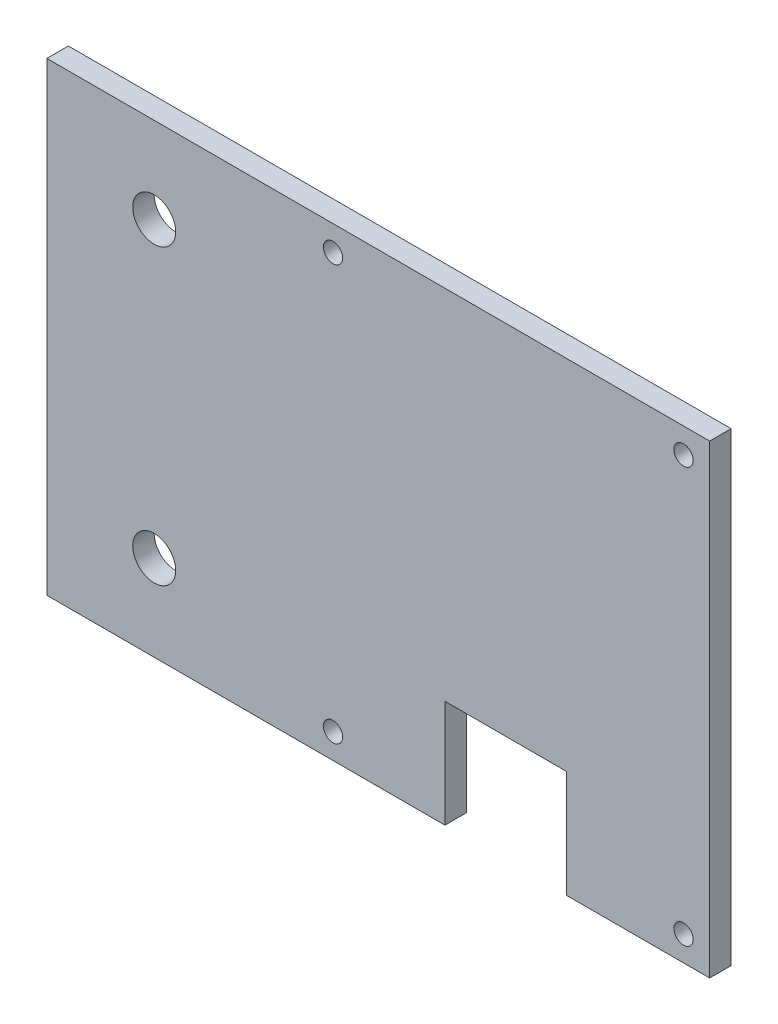
ISO-10303-21;
HEADER;
FILE_DESCRIPTION(('STEP AP214'),'2;1');
FILE_NAME('part.step','',(''),(''),'','','');
FILE_SCHEMA(('AUTOMOTIVE_DESIGN { 1 0 10303 214 1 1 1 1 }'));
ENDSEC;
DATA;
#1=APPLICATION_CONTEXT('core data for automotive mechanical design processes');
#2=APPLICATION_PROTOCOL_DEFINITION('international standard','automotive_design',2000,#1);
#3=PRODUCT_CONTEXT('',#1,'mechanical');
#4=PRODUCT('Part','Part','',(#3));
#5=PRODUCT_RELATED_PRODUCT_CATEGORY('part','',(#4));
#6=PRODUCT_DEFINITION_FORMATION('','',#4);
#7=PRODUCT_DEFINITION_CONTEXT('part definition',#1,'design');
#8=PRODUCT_DEFINITION('design','',#6,#7);
#9=PRODUCT_DEFINITION_SHAPE('','',#8);
#10=(LENGTH_UNIT() NAMED_UNIT(*) SI_UNIT(.MILLI.,.METRE.));
#11=(NAMED_UNIT(*) PLANE_ANGLE_UNIT() SI_UNIT($,.RADIAN.));
#12=(NAMED_UNIT(*) SI_UNIT($,.STERADIAN.) SOLID_ANGLE_UNIT());
#13=UNCERTAINTY_MEASURE_WITH_UNIT(LENGTH_MEASURE(1.E-05),#10,'distance_accuracy_value','');
#14=(GEOMETRIC_REPRESENTATION_CONTEXT(3) GLOBAL_UNCERTAINTY_ASSIGNED_CONTEXT((#13)) GLOBAL_UNIT_ASSIGNED_CONTEXT((#10,
#11,#12)) REPRESENTATION_CONTEXT('',''));
#15=CARTESIAN_POINT('',(0.,0.,0.));
#16=DIRECTION('',(0.,0.,1.));
#17=DIRECTION('',(1.,0.,0.));
#18=AXIS2_PLACEMENT_3D('',#15,#16,#17);
#19=CARTESIAN_POINT('',(0.,0.,3.));
#20=DIRECTION('',(0.,1.,0.));
#21=DIRECTION('',(0.,0.,1.));
#22=AXIS2_PLACEMENT_3D('',#19,#20,#21);
#23=PLANE('',#22);
#24=DIRECTION('',(1.,0.,0.));
#25=VECTOR('',#24,1.);
#26=CARTESIAN_POINT('',(0.,0.,0.));
#27=LINE('',#26,#25);
#28=CARTESIAN_POINT('',(0.,0.,0.));
#29=VERTEX_POINT('',#28);
#30=CARTESIAN_POINT('',(55.65,0.,0.));
#31=VERTEX_POINT('',#30);
#32=EDGE_CURVE('E134',#29,#31,#27,.T.);
#33=ORIENTED_EDGE('',*,*,#32,.T.);
#34=DIRECTION('',(0.,0.,1.));
#35=VECTOR('',#34,1.);
#36=CARTESIAN_POINT('',(55.65,0.,0.));
#37=LINE('',#36,#35);
#38=CARTESIAN_POINT('',(55.65,0.,3.));
#39=VERTEX_POINT('',#38);
#40=EDGE_CURVE('E118',#31,#39,#37,.T.);
#41=ORIENTED_EDGE('',*,*,#40,.T.);
#42=DIRECTION('',(1.,0.,0.));
#43=VECTOR('',#42,1.);
#44=CARTESIAN_POINT('',(0.,0.,3.));
#45=LINE('',#44,#43);
#46=CARTESIAN_POINT('',(0.,0.,3.));
#47=VERTEX_POINT('',#46);
#48=EDGE_CURVE('E96',#47,#39,#45,.T.);
#49=ORIENTED_EDGE('',*,*,#48,.F.);
#50=DIRECTION('',(0.,0.,-1.));
#51=VECTOR('',#50,1.);
#52=CARTESIAN_POINT('',(0.,0.,3.));
#53=LINE('',#52,#51);
#54=EDGE_CURVE('E11',#47,#29,#53,.T.);
#55=ORIENTED_EDGE('',*,*,#54,.T.);
#56=EDGE_LOOP('',(#33,#41,#49,#55));
#57=FACE_BOUND('',#56,.T.);
#58=ADVANCED_FACE('F43',(#57),#23,.F.);
#59=CARTESIAN_POINT('',(0.,0.,3.));
#60=DIRECTION('',(0.,0.,-1.));
#61=DIRECTION('',(-1.,0.,0.));
#62=AXIS2_PLACEMENT_3D('',#59,#60,#61);
#63=PLANE('',#62);
#64=CARTESIAN_POINT('',(15.,12.,3.));
#65=DIRECTION('',(0.,0.,-1.));
#66=DIRECTION('',(-1.,0.,0.));
#67=AXIS2_PLACEMENT_3D('',#64,#65,#66);
#68=CIRCLE('',#67,3.);
#69=CARTESIAN_POINT('',(12.,12.,3.));
#70=VERTEX_POINT('',#69);
#71=EDGE_CURVE('E215',#70,#70,#68,.T.);
#72=ORIENTED_EDGE('',*,*,#71,.T.);
#73=EDGE_LOOP('',(#72));
#74=FACE_BOUND('',#73,.T.);
#75=CARTESIAN_POINT('',(89.,61.5,3.));
#76=DIRECTION('',(0.,0.,1.));
#77=DIRECTION('',(1.,0.,0.));
#78=AXIS2_PLACEMENT_3D('',#75,#76,#77);
#79=CIRCLE('',#78,1.35000000000001);
#80=CARTESIAN_POINT('',(90.35,61.5,3.));
#81=VERTEX_POINT('',#80);
#82=EDGE_CURVE('E245',#81,#81,#79,.T.);
#83=ORIENTED_EDGE('',*,*,#82,.F.);
#84=EDGE_LOOP('',(#83));
#85=FACE_BOUND('',#84,.T.);
#86=CARTESIAN_POINT('',(89.,3.5,3.));
#87=DIRECTION('',(0.,0.,1.));
#88=DIRECTION('',(1.,0.,0.));
#89=AXIS2_PLACEMENT_3D('',#86,#87,#88);
#90=CIRCLE('',#89,1.35000000000001);
#91=CARTESIAN_POINT('',(90.35,3.5,3.));
#92=VERTEX_POINT('',#91);
#93=EDGE_CURVE('E249',#92,#92,#90,.T.);
#94=ORIENTED_EDGE('',*,*,#93,.F.);
#95=EDGE_LOOP('',(#94));
#96=FACE_BOUND('',#95,.T.);
#97=ORIENTED_EDGE('',*,*,#48,.T.);
#98=DIRECTION('',(0.,-1.,0.));
#99=VECTOR('',#98,1.);
#100=CARTESIAN_POINT('',(55.65,0.,3.));
#101=LINE('',#100,#99);
#102=CARTESIAN_POINT('',(55.65,15.,3.));
#103=VERTEX_POINT('',#102);
#104=EDGE_CURVE('E124',#103,#39,#101,.T.);
#105=ORIENTED_EDGE('',*,*,#104,.F.);
#106=DIRECTION('',(-1.,0.,0.));
#107=VECTOR('',#106,1.);
#108=CARTESIAN_POINT('',(55.65,15.,3.));
#109=LINE('',#108,#107);
#110=CARTESIAN_POINT('',(72.65,15.,3.));
#111=VERTEX_POINT('',#110);
#112=EDGE_CURVE('E137',#111,#103,#109,.T.);
#113=ORIENTED_EDGE('',*,*,#112,.F.);
#114=DIRECTION('',(0.,1.,0.));
#115=VECTOR('',#114,1.);
#116=CARTESIAN_POINT('',(72.65,0.,3.));
#117=LINE('',#116,#115);
#118=CARTESIAN_POINT('',(72.65,0.,3.));
#119=VERTEX_POINT('',#118);
#120=EDGE_CURVE('E214',#119,#111,#117,.T.);
#121=ORIENTED_EDGE('',*,*,#120,.F.);
#122=CARTESIAN_POINT('',(92.65,0.,3.));
#123=VERTEX_POINT('',#122);
#124=EDGE_CURVE('E198',#119,#123,#45,.T.);
#125=ORIENTED_EDGE('',*,*,#124,.T.);
#126=DIRECTION('',(0.,1.,0.));
#127=VECTOR('',#126,1.);
#128=CARTESIAN_POINT('',(92.65,0.,3.));
#129=LINE('',#128,#127);
#130=CARTESIAN_POINT('',(92.65,65.,3.));
#131=VERTEX_POINT('',#130);
#132=EDGE_CURVE('E171',#123,#131,#129,.T.);
#133=ORIENTED_EDGE('',*,*,#132,.T.);
#134=DIRECTION('',(-1.,0.,0.));
#135=VECTOR('',#134,1.);
#136=CARTESIAN_POINT('',(0.,65.,3.));
#137=LINE('',#136,#135);
#138=CARTESIAN_POINT('',(0.,65.,3.));
#139=VERTEX_POINT('',#138);
#140=EDGE_CURVE('E68',#131,#139,#137,.T.);
#141=ORIENTED_EDGE('',*,*,#140,.T.);
#142=DIRECTION('',(0.,-1.,0.));
#143=VECTOR('',#142,1.);
#144=CARTESIAN_POINT('',(0.,0.,3.));
#145=LINE('',#144,#143);
#146=EDGE_CURVE('E156',#139,#47,#145,.T.);
#147=ORIENTED_EDGE('',*,*,#146,.T.);
#148=EDGE_LOOP('',(#97,#105,#113,#121,#125,#133,#141,#147));
#149=FACE_BOUND('',#148,.T.);
#150=CARTESIAN_POINT('',(15.,53.,3.));
#151=DIRECTION('',(0.,0.,1.));
#152=DIRECTION('',(1.,0.,0.));
#153=AXIS2_PLACEMENT_3D('',#150,#151,#152);
#154=CIRCLE('',#153,3.);
#155=CARTESIAN_POINT('',(18.,53.,3.));
#156=VERTEX_POINT('',#155);
#157=EDGE_CURVE('E177',#156,#156,#154,.T.);
#158=ORIENTED_EDGE('',*,*,#157,.F.);
#159=EDGE_LOOP('',(#158));
#160=FACE_BOUND('',#159,.T.);
#161=CARTESIAN_POINT('',(40.,61.5,3.));
#162=DIRECTION('',(0.,0.,1.));
#163=DIRECTION('',(1.,0.,0.));
#164=AXIS2_PLACEMENT_3D('',#161,#162,#163);
#165=CIRCLE('',#164,1.35);
#166=CARTESIAN_POINT('',(41.35,61.5,3.));
#167=VERTEX_POINT('',#166);
#168=EDGE_CURVE('E190',#167,#167,#165,.T.);
#169=ORIENTED_EDGE('',*,*,#168,.F.);
#170=EDGE_LOOP('',(#169));
#171=FACE_BOUND('',#170,.T.);
#172=CARTESIAN_POINT('',(40.,3.5,3.));
#173=DIRECTION('',(0.,0.,1.));
#174=DIRECTION('',(1.,0.,0.));
#175=AXIS2_PLACEMENT_3D('',#172,#173,#174);
#176=CIRCLE('',#175,1.35);
#177=CARTESIAN_POINT('',(41.35,3.5,3.));
#178=VERTEX_POINT('',#177);
#179=EDGE_CURVE('E256',#178,#178,#176,.T.);
#180=ORIENTED_EDGE('',*,*,#179,.F.);
#181=EDGE_LOOP('',(#180));
#182=FACE_BOUND('',#181,.T.);
#183=ADVANCED_FACE('F206',(#74,#85,#96,#149,#160,#171,#182),#63,.F.);
#184=CARTESIAN_POINT('',(0.,0.,0.));
#185=DIRECTION('',(0.,0.,-1.));
#186=DIRECTION('',(-1.,0.,0.));
#187=AXIS2_PLACEMENT_3D('',#184,#185,#186);
#188=PLANE('',#187);
#189=CARTESIAN_POINT('',(15.,12.,0.));
#190=DIRECTION('',(0.,0.,-1.));
#191=DIRECTION('',(-1.,0.,0.));
#192=AXIS2_PLACEMENT_3D('',#189,#190,#191);
#193=CIRCLE('',#192,3.);
#194=CARTESIAN_POINT('',(12.,12.,0.));
#195=VERTEX_POINT('',#194);
#196=EDGE_CURVE('E224',#195,#195,#193,.T.);
#197=ORIENTED_EDGE('',*,*,#196,.F.);
#198=EDGE_LOOP('',(#197));
#199=FACE_BOUND('',#198,.T.);
#200=DIRECTION('',(0.,-1.,0.));
#201=VECTOR('',#200,1.);
#202=CARTESIAN_POINT('',(55.65,0.,0.));
#203=LINE('',#202,#201);
#204=CARTESIAN_POINT('',(55.65,15.,0.));
#205=VERTEX_POINT('',#204);
#206=EDGE_CURVE('E121',#205,#31,#203,.T.);
#207=ORIENTED_EDGE('',*,*,#206,.T.);
#208=ORIENTED_EDGE('',*,*,#32,.F.);
#209=DIRECTION('',(0.,-1.,0.));
#210=VECTOR('',#209,1.);
#211=CARTESIAN_POINT('',(0.,0.,0.));
#212=LINE('',#211,#210);
#213=CARTESIAN_POINT('',(0.,65.,0.));
#214=VERTEX_POINT('',#213);
#215=EDGE_CURVE('E150',#214,#29,#212,.T.);
#216=ORIENTED_EDGE('',*,*,#215,.F.);
#217=DIRECTION('',(-1.,0.,0.));
#218=VECTOR('',#217,1.);
#219=CARTESIAN_POINT('',(0.,65.,0.));
#220=LINE('',#219,#218);
#221=CARTESIAN_POINT('',(92.65,65.,0.));
#222=VERTEX_POINT('',#221);
#223=EDGE_CURVE('E89',#222,#214,#220,.T.);
#224=ORIENTED_EDGE('',*,*,#223,.F.);
#225=DIRECTION('',(0.,1.,0.));
#226=VECTOR('',#225,1.);
#227=CARTESIAN_POINT('',(92.65,0.,0.));
#228=LINE('',#227,#226);
#229=CARTESIAN_POINT('',(92.65,0.,0.));
#230=VERTEX_POINT('',#229);
#231=EDGE_CURVE('E142',#230,#222,#228,.T.);
#232=ORIENTED_EDGE('',*,*,#231,.F.);
#233=CARTESIAN_POINT('',(72.65,0.,0.));
#234=VERTEX_POINT('',#233);
#235=EDGE_CURVE('E143',#234,#230,#27,.T.);
#236=ORIENTED_EDGE('',*,*,#235,.F.);
#237=DIRECTION('',(0.,1.,0.));
#238=VECTOR('',#237,1.);
#239=CARTESIAN_POINT('',(72.65,0.,0.));
#240=LINE('',#239,#238);
#241=CARTESIAN_POINT('',(72.65,15.,0.));
#242=VERTEX_POINT('',#241);
#243=EDGE_CURVE('E59',#234,#242,#240,.T.);
#244=ORIENTED_EDGE('',*,*,#243,.T.);
#245=DIRECTION('',(-1.,0.,0.));
#246=VECTOR('',#245,1.);
#247=CARTESIAN_POINT('',(55.65,15.,0.));
#248=LINE('',#247,#246);
#249=EDGE_CURVE('E128',#242,#205,#248,.T.);
#250=ORIENTED_EDGE('',*,*,#249,.T.);
#251=EDGE_LOOP('',(#207,#208,#216,#224,#232,#236,#244,#250));
#252=FACE_BOUND('',#251,.T.);
#253=CARTESIAN_POINT('',(89.,61.5,0.));
#254=DIRECTION('',(0.,0.,1.));
#255=DIRECTION('',(1.,0.,0.));
#256=AXIS2_PLACEMENT_3D('',#253,#254,#255);
#257=CIRCLE('',#256,1.35000000000001);
#258=CARTESIAN_POINT('',(90.35,61.5,0.));
#259=VERTEX_POINT('',#258);
#260=EDGE_CURVE('E240',#259,#259,#257,.T.);
#261=ORIENTED_EDGE('',*,*,#260,.T.);
#262=EDGE_LOOP('',(#261));
#263=FACE_BOUND('',#262,.T.);
#264=CARTESIAN_POINT('',(89.,3.5,0.));
#265=DIRECTION('',(0.,0.,1.));
#266=DIRECTION('',(1.,0.,0.));
#267=AXIS2_PLACEMENT_3D('',#264,#265,#266);
#268=CIRCLE('',#267,1.35000000000001);
#269=CARTESIAN_POINT('',(90.35,3.5,0.));
#270=VERTEX_POINT('',#269);
#271=EDGE_CURVE('E234',#270,#270,#268,.T.);
#272=ORIENTED_EDGE('',*,*,#271,.T.);
#273=EDGE_LOOP('',(#272));
#274=FACE_BOUND('',#273,.T.);
#275=CARTESIAN_POINT('',(40.,61.5,0.));
#276=DIRECTION('',(0.,0.,1.));
#277=DIRECTION('',(1.,0.,0.));
#278=AXIS2_PLACEMENT_3D('',#275,#276,#277);
#279=CIRCLE('',#278,1.35);
#280=CARTESIAN_POINT('',(41.35,61.5,0.));
#281=VERTEX_POINT('',#280);
#282=EDGE_CURVE('E193',#281,#281,#279,.T.);
#283=ORIENTED_EDGE('',*,*,#282,.T.);
#284=EDGE_LOOP('',(#283));
#285=FACE_BOUND('',#284,.T.);
#286=CARTESIAN_POINT('',(15.,53.,0.));
#287=DIRECTION('',(0.,0.,1.));
#288=DIRECTION('',(1.,0.,0.));
#289=AXIS2_PLACEMENT_3D('',#286,#287,#288);
#290=CIRCLE('',#289,3.);
#291=CARTESIAN_POINT('',(18.,53.,0.));
#292=VERTEX_POINT('',#291);
#293=EDGE_CURVE('E182',#292,#292,#290,.T.);
#294=ORIENTED_EDGE('',*,*,#293,.T.);
#295=EDGE_LOOP('',(#294));
#296=FACE_BOUND('',#295,.T.);
#297=CARTESIAN_POINT('',(40.,3.5,0.));
#298=DIRECTION('',(0.,0.,1.));
#299=DIRECTION('',(1.,0.,0.));
#300=AXIS2_PLACEMENT_3D('',#297,#298,#299);
#301=CIRCLE('',#300,1.35);
#302=CARTESIAN_POINT('',(41.35,3.5,0.));
#303=VERTEX_POINT('',#302);
#304=EDGE_CURVE('E244',#303,#303,#301,.T.);
#305=ORIENTED_EDGE('',*,*,#304,.T.);
#306=EDGE_LOOP('',(#305));
#307=FACE_BOUND('',#306,.T.);
#308=ADVANCED_FACE('F131',(#199,#252,#263,#274,#285,#296,#307),#188,.T.);
#309=CARTESIAN_POINT('',(0.,0.,3.));
#310=DIRECTION('',(1.,0.,0.));
#311=DIRECTION('',(0.,0.,-1.));
#312=AXIS2_PLACEMENT_3D('',#309,#310,#311);
#313=PLANE('',#312);
#314=ORIENTED_EDGE('',*,*,#215,.T.);
#315=ORIENTED_EDGE('',*,*,#54,.F.);
#316=ORIENTED_EDGE('',*,*,#146,.F.);
#317=DIRECTION('',(0.,0.,-1.));
#318=VECTOR('',#317,1.);
#319=CARTESIAN_POINT('',(0.,65.,3.));
#320=LINE('',#319,#318);
#321=EDGE_CURVE('E157',#139,#214,#320,.T.);
#322=ORIENTED_EDGE('',*,*,#321,.T.);
#323=EDGE_LOOP('',(#314,#315,#316,#322));
#324=FACE_BOUND('',#323,.T.);
#325=ADVANCED_FACE('F45',(#324),#313,.F.);
#326=ORIENTED_EDGE('',*,*,#124,.F.);
#327=DIRECTION('',(0.,0.,1.));
#328=VECTOR('',#327,1.);
#329=CARTESIAN_POINT('',(72.65,0.,0.));
#330=LINE('',#329,#328);
#331=EDGE_CURVE('E127',#234,#119,#330,.T.);
#332=ORIENTED_EDGE('',*,*,#331,.F.);
#333=ORIENTED_EDGE('',*,*,#235,.T.);
#334=DIRECTION('',(0.,0.,-1.));
#335=VECTOR('',#334,1.);
#336=CARTESIAN_POINT('',(92.65,0.,3.));
#337=LINE('',#336,#335);
#338=EDGE_CURVE('E52',#123,#230,#337,.T.);
#339=ORIENTED_EDGE('',*,*,#338,.F.);
#340=EDGE_LOOP('',(#326,#332,#333,#339));
#341=FACE_BOUND('',#340,.T.);
#342=ADVANCED_FACE('F286',(#341),#23,.F.);
#343=CARTESIAN_POINT('',(92.65,0.,3.));
#344=DIRECTION('',(-1.,0.,0.));
#345=DIRECTION('',(0.,0.,1.));
#346=AXIS2_PLACEMENT_3D('',#343,#344,#345);
#347=PLANE('',#346);
#348=ORIENTED_EDGE('',*,*,#231,.T.);
#349=DIRECTION('',(0.,0.,-1.));
#350=VECTOR('',#349,1.);
#351=CARTESIAN_POINT('',(92.65,65.,3.));
#352=LINE('',#351,#350);
#353=EDGE_CURVE('E160',#131,#222,#352,.T.);
#354=ORIENTED_EDGE('',*,*,#353,.F.);
#355=ORIENTED_EDGE('',*,*,#132,.F.);
#356=ORIENTED_EDGE('',*,*,#338,.T.);
#357=EDGE_LOOP('',(#348,#354,#355,#356));
#358=FACE_BOUND('',#357,.T.);
#359=ADVANCED_FACE('F169',(#358),#347,.F.);
#360=CARTESIAN_POINT('',(0.,65.,3.));
#361=DIRECTION('',(0.,-1.,0.));
#362=DIRECTION('',(0.,0.,-1.));
#363=AXIS2_PLACEMENT_3D('',#360,#361,#362);
#364=PLANE('',#363);
#365=ORIENTED_EDGE('',*,*,#223,.T.);
#366=ORIENTED_EDGE('',*,*,#321,.F.);
#367=ORIENTED_EDGE('',*,*,#140,.F.);
#368=ORIENTED_EDGE('',*,*,#353,.T.);
#369=EDGE_LOOP('',(#365,#366,#367,#368));
#370=FACE_BOUND('',#369,.T.);
#371=ADVANCED_FACE('F209',(#370),#364,.F.);
#372=CARTESIAN_POINT('',(15.,53.,3.));
#373=DIRECTION('',(0.,0.,-1.));
#374=DIRECTION('',(-1.,0.,0.));
#375=AXIS2_PLACEMENT_3D('',#372,#373,#374);
#376=CYLINDRICAL_SURFACE('',#375,3.);
#377=ORIENTED_EDGE('',*,*,#157,.T.);
#378=EDGE_LOOP('',(#377));
#379=FACE_BOUND('',#378,.T.);
#380=ORIENTED_EDGE('',*,*,#293,.F.);
#381=EDGE_LOOP('',(#380));
#382=FACE_BOUND('',#381,.T.);
#383=ADVANCED_FACE('F275',(#379,#382),#376,.F.);
#384=CARTESIAN_POINT('',(40.,61.5,3.));
#385=DIRECTION('',(0.,0.,-1.));
#386=DIRECTION('',(-1.,0.,0.));
#387=AXIS2_PLACEMENT_3D('',#384,#385,#386);
#388=CYLINDRICAL_SURFACE('',#387,1.35);
#389=ORIENTED_EDGE('',*,*,#168,.T.);
#390=EDGE_LOOP('',(#389));
#391=FACE_BOUND('',#390,.T.);
#392=ORIENTED_EDGE('',*,*,#282,.F.);
#393=EDGE_LOOP('',(#392));
#394=FACE_BOUND('',#393,.T.);
#395=ADVANCED_FACE('F272',(#391,#394),#388,.F.);
#396=CARTESIAN_POINT('',(40.,3.5,3.));
#397=DIRECTION('',(0.,0.,-1.));
#398=DIRECTION('',(-1.,0.,0.));
#399=AXIS2_PLACEMENT_3D('',#396,#397,#398);
#400=CYLINDRICAL_SURFACE('',#399,1.35);
#401=ORIENTED_EDGE('',*,*,#179,.T.);
#402=EDGE_LOOP('',(#401));
#403=FACE_BOUND('',#402,.T.);
#404=ORIENTED_EDGE('',*,*,#304,.F.);
#405=EDGE_LOOP('',(#404));
#406=FACE_BOUND('',#405,.T.);
#407=ADVANCED_FACE('F274',(#403,#406),#400,.F.);
#408=CARTESIAN_POINT('',(89.,3.5,0.));
#409=DIRECTION('',(0.,0.,1.));
#410=DIRECTION('',(1.,0.,0.));
#411=AXIS2_PLACEMENT_3D('',#408,#409,#410);
#412=CYLINDRICAL_SURFACE('',#411,1.35000000000001);
#413=ORIENTED_EDGE('',*,*,#271,.F.);
#414=EDGE_LOOP('',(#413));
#415=FACE_BOUND('',#414,.T.);
#416=ORIENTED_EDGE('',*,*,#93,.T.);
#417=EDGE_LOOP('',(#416));
#418=FACE_BOUND('',#417,.T.);
#419=ADVANCED_FACE('F281',(#415,#418),#412,.F.);
#420=CARTESIAN_POINT('',(89.,61.5,0.));
#421=DIRECTION('',(0.,0.,1.));
#422=DIRECTION('',(1.,0.,0.));
#423=AXIS2_PLACEMENT_3D('',#420,#421,#422);
#424=CYLINDRICAL_SURFACE('',#423,1.35000000000001);
#425=ORIENTED_EDGE('',*,*,#260,.F.);
#426=EDGE_LOOP('',(#425));
#427=FACE_BOUND('',#426,.T.);
#428=ORIENTED_EDGE('',*,*,#82,.T.);
#429=EDGE_LOOP('',(#428));
#430=FACE_BOUND('',#429,.T.);
#431=ADVANCED_FACE('F355',(#427,#430),#424,.F.);
#432=CARTESIAN_POINT('',(55.65,0.,0.));
#433=DIRECTION('',(-1.,0.,0.));
#434=DIRECTION('',(0.,0.,1.));
#435=AXIS2_PLACEMENT_3D('',#432,#433,#434);
#436=PLANE('',#435);
#437=ORIENTED_EDGE('',*,*,#104,.T.);
#438=ORIENTED_EDGE('',*,*,#40,.F.);
#439=ORIENTED_EDGE('',*,*,#206,.F.);
#440=DIRECTION('',(0.,0.,1.));
#441=VECTOR('',#440,1.);
#442=CARTESIAN_POINT('',(55.65,15.,0.));
#443=LINE('',#442,#441);
#444=EDGE_CURVE('E231',#205,#103,#443,.T.);
#445=ORIENTED_EDGE('',*,*,#444,.T.);
#446=EDGE_LOOP('',(#437,#438,#439,#445));
#447=FACE_BOUND('',#446,.T.);
#448=ADVANCED_FACE('F120',(#447),#436,.F.);
#449=CARTESIAN_POINT('',(55.65,15.,0.));
#450=DIRECTION('',(0.,1.,0.));
#451=DIRECTION('',(0.,0.,1.));
#452=AXIS2_PLACEMENT_3D('',#449,#450,#451);
#453=PLANE('',#452);
#454=ORIENTED_EDGE('',*,*,#112,.T.);
#455=ORIENTED_EDGE('',*,*,#444,.F.);
#456=ORIENTED_EDGE('',*,*,#249,.F.);
#457=DIRECTION('',(0.,0.,1.));
#458=VECTOR('',#457,1.);
#459=CARTESIAN_POINT('',(72.65,15.,0.));
#460=LINE('',#459,#458);
#461=EDGE_CURVE('E235',#242,#111,#460,.T.);
#462=ORIENTED_EDGE('',*,*,#461,.T.);
#463=EDGE_LOOP('',(#454,#455,#456,#462));
#464=FACE_BOUND('',#463,.T.);
#465=ADVANCED_FACE('F307',(#464),#453,.F.);
#466=CARTESIAN_POINT('',(72.65,0.,0.));
#467=DIRECTION('',(1.,0.,0.));
#468=DIRECTION('',(0.,0.,-1.));
#469=AXIS2_PLACEMENT_3D('',#466,#467,#468);
#470=PLANE('',#469);
#471=ORIENTED_EDGE('',*,*,#120,.T.);
#472=ORIENTED_EDGE('',*,*,#461,.F.);
#473=ORIENTED_EDGE('',*,*,#243,.F.);
#474=ORIENTED_EDGE('',*,*,#331,.T.);
#475=EDGE_LOOP('',(#471,#472,#473,#474));
#476=FACE_BOUND('',#475,.T.);
#477=ADVANCED_FACE('F305',(#476),#470,.F.);
#478=CARTESIAN_POINT('',(15.,12.,3.));
#479=DIRECTION('',(0.,0.,-1.));
#480=DIRECTION('',(-1.,0.,0.));
#481=AXIS2_PLACEMENT_3D('',#478,#479,#480);
#482=CYLINDRICAL_SURFACE('',#481,3.);
#483=ORIENTED_EDGE('',*,*,#71,.F.);
#484=EDGE_LOOP('',(#483));
#485=FACE_BOUND('',#484,.T.);
#486=ORIENTED_EDGE('',*,*,#196,.T.);
#487=EDGE_LOOP('',(#486));
#488=FACE_BOUND('',#487,.T.);
#489=ADVANCED_FACE('F317',(#485,#488),#482,.F.);
#490=CLOSED_SHELL('',(#58,#183,#308,#325,#342,#359,#371,#383,#395,#407,#419,#431,#448,#465,#477,#489));
#491=MANIFOLD_SOLID_BREP('B2',#490);
#492=ADVANCED_BREP_SHAPE_REPRESENTATION('',(#18,#491),#14);
#493=SHAPE_DEFINITION_REPRESENTATION(#9,#492);
ENDSEC;
END-ISO-10303-21;
